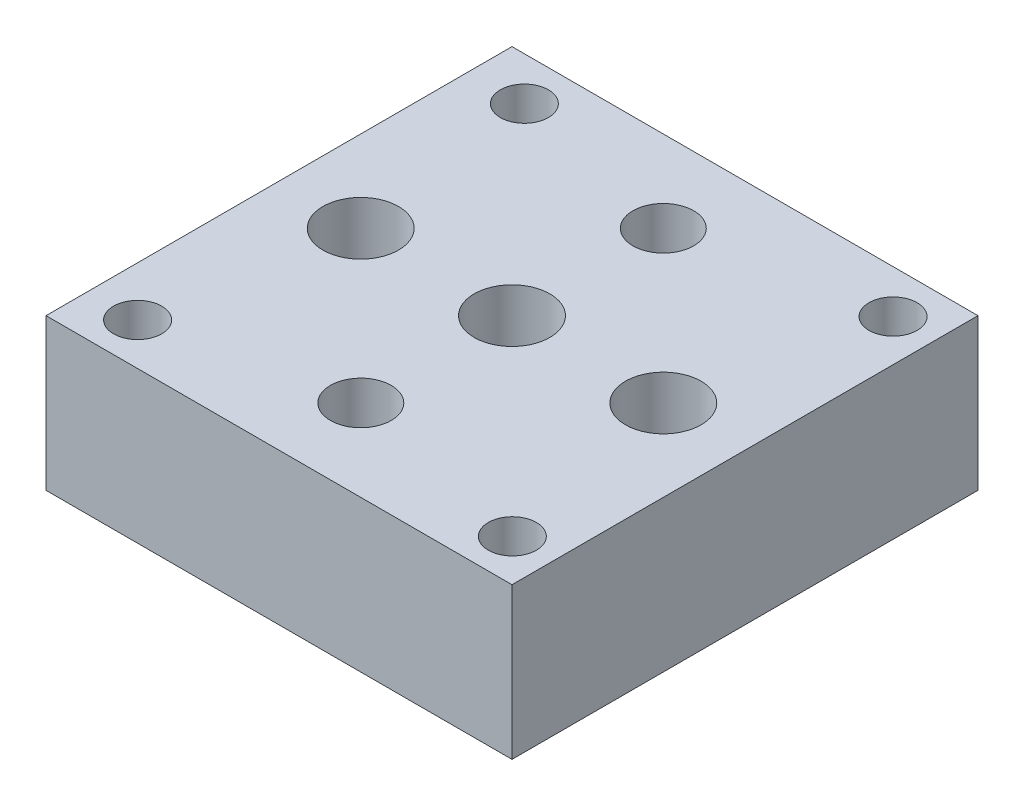
ISO-10303-21;
HEADER;
FILE_DESCRIPTION(('STEP AP214'),'2;1');
FILE_NAME('part.step','',(''),(''),'','','');
FILE_SCHEMA(('AUTOMOTIVE_DESIGN { 1 0 10303 214 1 1 1 1 }'));
ENDSEC;
DATA;
#1=APPLICATION_CONTEXT('core data for automotive mechanical design processes');
#2=APPLICATION_PROTOCOL_DEFINITION('international standard','automotive_design',2000,#1);
#3=PRODUCT_CONTEXT('',#1,'mechanical');
#4=PRODUCT('Part','Part','',(#3));
#5=PRODUCT_RELATED_PRODUCT_CATEGORY('part','',(#4));
#6=PRODUCT_DEFINITION_FORMATION('','',#4);
#7=PRODUCT_DEFINITION_CONTEXT('part definition',#1,'design');
#8=PRODUCT_DEFINITION('design','',#6,#7);
#9=PRODUCT_DEFINITION_SHAPE('','',#8);
#10=(LENGTH_UNIT() NAMED_UNIT(*) SI_UNIT(.MILLI.,.METRE.));
#11=(NAMED_UNIT(*) PLANE_ANGLE_UNIT() SI_UNIT($,.RADIAN.));
#12=(NAMED_UNIT(*) SI_UNIT($,.STERADIAN.) SOLID_ANGLE_UNIT());
#13=UNCERTAINTY_MEASURE_WITH_UNIT(LENGTH_MEASURE(1.E-05),#10,'distance_accuracy_value','');
#14=(GEOMETRIC_REPRESENTATION_CONTEXT(3) GLOBAL_UNCERTAINTY_ASSIGNED_CONTEXT((#13)) GLOBAL_UNIT_ASSIGNED_CONTEXT((#10,
#11,#12)) REPRESENTATION_CONTEXT('',''));
#15=CARTESIAN_POINT('',(0.,0.,0.));
#16=DIRECTION('',(0.,0.,1.));
#17=DIRECTION('',(1.,0.,0.));
#18=AXIS2_PLACEMENT_3D('',#15,#16,#17);
#19=CARTESIAN_POINT('',(19.558,12.7,-19.558));
#20=DIRECTION('',(-1.,0.,0.));
#21=DIRECTION('',(0.,0.,1.));
#22=AXIS2_PLACEMENT_3D('',#19,#20,#21);
#23=PLANE('',#22);
#24=DIRECTION('',(0.,0.,-1.));
#25=VECTOR('',#24,1.);
#26=CARTESIAN_POINT('',(19.558,0.,-19.558));
#27=LINE('',#26,#25);
#28=CARTESIAN_POINT('',(19.558,0.,19.558));
#29=VERTEX_POINT('',#28);
#30=CARTESIAN_POINT('',(19.558,0.,-19.558));
#31=VERTEX_POINT('',#30);
#32=EDGE_CURVE('E98',#29,#31,#27,.T.);
#33=ORIENTED_EDGE('',*,*,#32,.T.);
#34=DIRECTION('',(0.,-1.,0.));
#35=VECTOR('',#34,1.);
#36=CARTESIAN_POINT('',(19.558,12.7,-19.558));
#37=LINE('',#36,#35);
#38=CARTESIAN_POINT('',(19.558,12.7,-19.558));
#39=VERTEX_POINT('',#38);
#40=EDGE_CURVE('E11',#39,#31,#37,.T.);
#41=ORIENTED_EDGE('',*,*,#40,.F.);
#42=DIRECTION('',(0.,0.,-1.));
#43=VECTOR('',#42,1.);
#44=CARTESIAN_POINT('',(19.558,12.7,-19.558));
#45=LINE('',#44,#43);
#46=CARTESIAN_POINT('',(19.558,12.7,19.558));
#47=VERTEX_POINT('',#46);
#48=EDGE_CURVE('E86',#47,#39,#45,.T.);
#49=ORIENTED_EDGE('',*,*,#48,.F.);
#50=DIRECTION('',(0.,-1.,0.));
#51=VECTOR('',#50,1.);
#52=CARTESIAN_POINT('',(19.558,12.7,19.558));
#53=LINE('',#52,#51);
#54=EDGE_CURVE('E94',#47,#29,#53,.T.);
#55=ORIENTED_EDGE('',*,*,#54,.T.);
#56=EDGE_LOOP('',(#33,#41,#49,#55));
#57=FACE_BOUND('',#56,.T.);
#58=ADVANCED_FACE('F35',(#57),#23,.F.);
#59=CARTESIAN_POINT('',(-19.558,12.7,-19.558));
#60=DIRECTION('',(0.,0.,1.));
#61=DIRECTION('',(1.,0.,0.));
#62=AXIS2_PLACEMENT_3D('',#59,#60,#61);
#63=PLANE('',#62);
#64=DIRECTION('',(-1.,0.,0.));
#65=VECTOR('',#64,1.);
#66=CARTESIAN_POINT('',(-19.558,0.,-19.558));
#67=LINE('',#66,#65);
#68=CARTESIAN_POINT('',(-19.558,0.,-19.558));
#69=VERTEX_POINT('',#68);
#70=EDGE_CURVE('E90',#31,#69,#67,.T.);
#71=ORIENTED_EDGE('',*,*,#70,.T.);
#72=DIRECTION('',(0.,-1.,0.));
#73=VECTOR('',#72,1.);
#74=CARTESIAN_POINT('',(-19.558,12.7,-19.558));
#75=LINE('',#74,#73);
#76=CARTESIAN_POINT('',(-19.558,12.7,-19.558));
#77=VERTEX_POINT('',#76);
#78=EDGE_CURVE('E43',#77,#69,#75,.T.);
#79=ORIENTED_EDGE('',*,*,#78,.F.);
#80=DIRECTION('',(-1.,0.,0.));
#81=VECTOR('',#80,1.);
#82=CARTESIAN_POINT('',(-19.558,12.7,-19.558));
#83=LINE('',#82,#81);
#84=EDGE_CURVE('E81',#39,#77,#83,.T.);
#85=ORIENTED_EDGE('',*,*,#84,.F.);
#86=ORIENTED_EDGE('',*,*,#40,.T.);
#87=EDGE_LOOP('',(#71,#79,#85,#86));
#88=FACE_BOUND('',#87,.T.);
#89=ADVANCED_FACE('F89',(#88),#63,.F.);
#90=CARTESIAN_POINT('',(-19.558,12.7,-19.558));
#91=DIRECTION('',(1.,0.,0.));
#92=DIRECTION('',(0.,0.,-1.));
#93=AXIS2_PLACEMENT_3D('',#90,#91,#92);
#94=PLANE('',#93);
#95=DIRECTION('',(0.,0.,1.));
#96=VECTOR('',#95,1.);
#97=CARTESIAN_POINT('',(-19.558,0.,-19.558));
#98=LINE('',#97,#96);
#99=CARTESIAN_POINT('',(-19.558,0.,19.558));
#100=VERTEX_POINT('',#99);
#101=EDGE_CURVE('E68',#69,#100,#98,.T.);
#102=ORIENTED_EDGE('',*,*,#101,.T.);
#103=DIRECTION('',(0.,-1.,0.));
#104=VECTOR('',#103,1.);
#105=CARTESIAN_POINT('',(-19.558,12.7,19.558));
#106=LINE('',#105,#104);
#107=CARTESIAN_POINT('',(-19.558,12.7,19.558));
#108=VERTEX_POINT('',#107);
#109=EDGE_CURVE('E91',#108,#100,#106,.T.);
#110=ORIENTED_EDGE('',*,*,#109,.F.);
#111=DIRECTION('',(0.,0.,1.));
#112=VECTOR('',#111,1.);
#113=CARTESIAN_POINT('',(-19.558,12.7,-19.558));
#114=LINE('',#113,#112);
#115=EDGE_CURVE('E84',#77,#108,#114,.T.);
#116=ORIENTED_EDGE('',*,*,#115,.F.);
#117=ORIENTED_EDGE('',*,*,#78,.T.);
#118=EDGE_LOOP('',(#102,#110,#116,#117));
#119=FACE_BOUND('',#118,.T.);
#120=ADVANCED_FACE('F92',(#119),#94,.F.);
#121=CARTESIAN_POINT('',(-19.558,12.7,19.558));
#122=DIRECTION('',(0.,0.,-1.));
#123=DIRECTION('',(-1.,0.,0.));
#124=AXIS2_PLACEMENT_3D('',#121,#122,#123);
#125=PLANE('',#124);
#126=DIRECTION('',(1.,0.,0.));
#127=VECTOR('',#126,1.);
#128=CARTESIAN_POINT('',(-19.558,0.,19.558));
#129=LINE('',#128,#127);
#130=EDGE_CURVE('E74',#100,#29,#129,.T.);
#131=ORIENTED_EDGE('',*,*,#130,.T.);
#132=ORIENTED_EDGE('',*,*,#54,.F.);
#133=DIRECTION('',(1.,0.,0.));
#134=VECTOR('',#133,1.);
#135=CARTESIAN_POINT('',(-19.558,12.7,19.558));
#136=LINE('',#135,#134);
#137=EDGE_CURVE('E51',#108,#47,#136,.T.);
#138=ORIENTED_EDGE('',*,*,#137,.F.);
#139=ORIENTED_EDGE('',*,*,#109,.T.);
#140=EDGE_LOOP('',(#131,#132,#138,#139));
#141=FACE_BOUND('',#140,.T.);
#142=ADVANCED_FACE('F106',(#141),#125,.F.);
#143=CARTESIAN_POINT('',(0.,12.7,0.));
#144=DIRECTION('',(0.,1.,0.));
#145=DIRECTION('',(0.,0.,1.));
#146=AXIS2_PLACEMENT_3D('',#143,#144,#145);
#147=PLANE('',#146);
#148=CARTESIAN_POINT('',(0.,12.7,-12.7));
#149=DIRECTION('',(0.,1.,0.));
#150=DIRECTION('',(0.,0.,1.));
#151=AXIS2_PLACEMENT_3D('',#148,#149,#150);
#152=CIRCLE('',#151,2.55269999999999);
#153=CARTESIAN_POINT('',(0.,12.7,-10.1473));
#154=VERTEX_POINT('',#153);
#155=EDGE_CURVE('E162',#154,#154,#152,.T.);
#156=ORIENTED_EDGE('',*,*,#155,.F.);
#157=EDGE_LOOP('',(#156));
#158=FACE_BOUND('',#157,.T.);
#159=CARTESIAN_POINT('',(0.,12.7,12.6906819658927));
#160=DIRECTION('',(0.,1.,0.));
#161=DIRECTION('',(0.,0.,1.));
#162=AXIS2_PLACEMENT_3D('',#159,#160,#161);
#163=CIRCLE('',#162,2.55269999999999);
#164=CARTESIAN_POINT('',(0.,12.7,15.2433819658927));
#165=VERTEX_POINT('',#164);
#166=EDGE_CURVE('E156',#165,#165,#163,.T.);
#167=ORIENTED_EDGE('',*,*,#166,.F.);
#168=EDGE_LOOP('',(#167));
#169=FACE_BOUND('',#168,.T.);
#170=CARTESIAN_POINT('',(-12.7,12.7,0.));
#171=DIRECTION('',(0.,1.,0.));
#172=DIRECTION('',(0.,0.,1.));
#173=AXIS2_PLACEMENT_3D('',#170,#171,#172);
#174=CIRCLE('',#173,3.17499999999999);
#175=CARTESIAN_POINT('',(-12.7,12.7,3.17499999999999));
#176=VERTEX_POINT('',#175);
#177=EDGE_CURVE('E150',#176,#176,#174,.T.);
#178=ORIENTED_EDGE('',*,*,#177,.F.);
#179=EDGE_LOOP('',(#178));
#180=FACE_BOUND('',#179,.T.);
#181=CARTESIAN_POINT('',(12.7,12.7,0.));
#182=DIRECTION('',(0.,1.,0.));
#183=DIRECTION('',(0.,0.,1.));
#184=AXIS2_PLACEMENT_3D('',#181,#182,#183);
#185=CIRCLE('',#184,3.17499999999999);
#186=CARTESIAN_POINT('',(12.7,12.7,3.17499999999999));
#187=VERTEX_POINT('',#186);
#188=EDGE_CURVE('E144',#187,#187,#185,.T.);
#189=ORIENTED_EDGE('',*,*,#188,.F.);
#190=EDGE_LOOP('',(#189));
#191=FACE_BOUND('',#190,.T.);
#192=CARTESIAN_POINT('',(0.,12.7,0.));
#193=DIRECTION('',(0.,1.,0.));
#194=DIRECTION('',(0.,0.,1.));
#195=AXIS2_PLACEMENT_3D('',#192,#193,#194);
#196=CIRCLE('',#195,3.17499999999999);
#197=CARTESIAN_POINT('',(0.,12.7,3.17499999999999));
#198=VERTEX_POINT('',#197);
#199=EDGE_CURVE('E138',#198,#198,#196,.T.);
#200=ORIENTED_EDGE('',*,*,#199,.F.);
#201=EDGE_LOOP('',(#200));
#202=FACE_BOUND('',#201,.T.);
#203=CARTESIAN_POINT('',(-14.89,12.7,-15.928));
#204=DIRECTION('',(0.,1.,0.));
#205=DIRECTION('',(0.,0.,1.));
#206=AXIS2_PLACEMENT_3D('',#203,#204,#205);
#207=CIRCLE('',#206,2.0193);
#208=CARTESIAN_POINT('',(-14.89,12.7,-13.9087));
#209=VERTEX_POINT('',#208);
#210=EDGE_CURVE('E132',#209,#209,#207,.T.);
#211=ORIENTED_EDGE('',*,*,#210,.F.);
#212=EDGE_LOOP('',(#211));
#213=FACE_BOUND('',#212,.T.);
#214=CARTESIAN_POINT('',(-15.398,12.7,16.028));
#215=DIRECTION('',(0.,1.,0.));
#216=DIRECTION('',(0.,0.,1.));
#217=AXIS2_PLACEMENT_3D('',#214,#215,#216);
#218=CIRCLE('',#217,2.0193);
#219=CARTESIAN_POINT('',(-15.398,12.7,18.0473));
#220=VERTEX_POINT('',#219);
#221=EDGE_CURVE('E126',#220,#220,#218,.T.);
#222=ORIENTED_EDGE('',*,*,#221,.F.);
#223=EDGE_LOOP('',(#222));
#224=FACE_BOUND('',#223,.T.);
#225=CARTESIAN_POINT('',(16.0580000000001,12.7,16.028));
#226=DIRECTION('',(0.,1.,0.));
#227=DIRECTION('',(0.,0.,1.));
#228=AXIS2_PLACEMENT_3D('',#225,#226,#227);
#229=CIRCLE('',#228,2.0193);
#230=CARTESIAN_POINT('',(16.0580000000001,12.7,18.0473));
#231=VERTEX_POINT('',#230);
#232=EDGE_CURVE('E120',#231,#231,#229,.T.);
#233=ORIENTED_EDGE('',*,*,#232,.F.);
#234=EDGE_LOOP('',(#233));
#235=FACE_BOUND('',#234,.T.);
#236=CARTESIAN_POINT('',(16.058,12.7,-15.928));
#237=DIRECTION('',(0.,1.,0.));
#238=DIRECTION('',(0.,0.,1.));
#239=AXIS2_PLACEMENT_3D('',#236,#237,#238);
#240=CIRCLE('',#239,2.0193);
#241=CARTESIAN_POINT('',(16.058,12.7,-13.9087));
#242=VERTEX_POINT('',#241);
#243=EDGE_CURVE('E114',#242,#242,#240,.T.);
#244=ORIENTED_EDGE('',*,*,#243,.F.);
#245=EDGE_LOOP('',(#244));
#246=FACE_BOUND('',#245,.T.);
#247=ORIENTED_EDGE('',*,*,#48,.T.);
#248=ORIENTED_EDGE('',*,*,#84,.T.);
#249=ORIENTED_EDGE('',*,*,#115,.T.);
#250=ORIENTED_EDGE('',*,*,#137,.T.);
#251=EDGE_LOOP('',(#247,#248,#249,#250));
#252=FACE_BOUND('',#251,.T.);
#253=ADVANCED_FACE('F82',(#158,#169,#180,#191,#202,#213,#224,#235,#246,#252),#147,.T.);
#254=CARTESIAN_POINT('',(0.,0.,0.));
#255=DIRECTION('',(0.,1.,0.));
#256=DIRECTION('',(0.,0.,1.));
#257=AXIS2_PLACEMENT_3D('',#254,#255,#256);
#258=PLANE('',#257);
#259=CARTESIAN_POINT('',(0.,0.,-12.7));
#260=DIRECTION('',(0.,1.,0.));
#261=DIRECTION('',(0.,0.,1.));
#262=AXIS2_PLACEMENT_3D('',#259,#260,#261);
#263=CIRCLE('',#262,2.55269999999999);
#264=CARTESIAN_POINT('',(0.,0.,-10.1473));
#265=VERTEX_POINT('',#264);
#266=EDGE_CURVE('E159',#265,#265,#263,.T.);
#267=ORIENTED_EDGE('',*,*,#266,.T.);
#268=EDGE_LOOP('',(#267));
#269=FACE_BOUND('',#268,.T.);
#270=CARTESIAN_POINT('',(0.,0.,12.6906819658927));
#271=DIRECTION('',(0.,1.,0.));
#272=DIRECTION('',(0.,0.,1.));
#273=AXIS2_PLACEMENT_3D('',#270,#271,#272);
#274=CIRCLE('',#273,2.55269999999999);
#275=CARTESIAN_POINT('',(0.,0.,15.2433819658927));
#276=VERTEX_POINT('',#275);
#277=EDGE_CURVE('E153',#276,#276,#274,.T.);
#278=ORIENTED_EDGE('',*,*,#277,.T.);
#279=EDGE_LOOP('',(#278));
#280=FACE_BOUND('',#279,.T.);
#281=CARTESIAN_POINT('',(-12.7,0.,0.));
#282=DIRECTION('',(0.,1.,0.));
#283=DIRECTION('',(0.,0.,1.));
#284=AXIS2_PLACEMENT_3D('',#281,#282,#283);
#285=CIRCLE('',#284,3.17499999999999);
#286=CARTESIAN_POINT('',(-12.7,0.,3.17499999999999));
#287=VERTEX_POINT('',#286);
#288=EDGE_CURVE('E147',#287,#287,#285,.T.);
#289=ORIENTED_EDGE('',*,*,#288,.T.);
#290=EDGE_LOOP('',(#289));
#291=FACE_BOUND('',#290,.T.);
#292=CARTESIAN_POINT('',(12.7,0.,0.));
#293=DIRECTION('',(0.,1.,0.));
#294=DIRECTION('',(0.,0.,1.));
#295=AXIS2_PLACEMENT_3D('',#292,#293,#294);
#296=CIRCLE('',#295,3.17499999999999);
#297=CARTESIAN_POINT('',(12.7,0.,3.17499999999999));
#298=VERTEX_POINT('',#297);
#299=EDGE_CURVE('E141',#298,#298,#296,.T.);
#300=ORIENTED_EDGE('',*,*,#299,.T.);
#301=EDGE_LOOP('',(#300));
#302=FACE_BOUND('',#301,.T.);
#303=CARTESIAN_POINT('',(0.,0.,0.));
#304=DIRECTION('',(0.,1.,0.));
#305=DIRECTION('',(0.,0.,1.));
#306=AXIS2_PLACEMENT_3D('',#303,#304,#305);
#307=CIRCLE('',#306,3.17499999999999);
#308=CARTESIAN_POINT('',(0.,0.,3.17499999999999));
#309=VERTEX_POINT('',#308);
#310=EDGE_CURVE('E135',#309,#309,#307,.T.);
#311=ORIENTED_EDGE('',*,*,#310,.T.);
#312=EDGE_LOOP('',(#311));
#313=FACE_BOUND('',#312,.T.);
#314=CARTESIAN_POINT('',(-14.89,0.,-15.928));
#315=DIRECTION('',(0.,1.,0.));
#316=DIRECTION('',(0.,0.,1.));
#317=AXIS2_PLACEMENT_3D('',#314,#315,#316);
#318=CIRCLE('',#317,2.0193);
#319=CARTESIAN_POINT('',(-14.89,0.,-13.9087));
#320=VERTEX_POINT('',#319);
#321=EDGE_CURVE('E129',#320,#320,#318,.T.);
#322=ORIENTED_EDGE('',*,*,#321,.T.);
#323=EDGE_LOOP('',(#322));
#324=FACE_BOUND('',#323,.T.);
#325=CARTESIAN_POINT('',(-15.398,0.,16.028));
#326=DIRECTION('',(0.,1.,0.));
#327=DIRECTION('',(0.,0.,1.));
#328=AXIS2_PLACEMENT_3D('',#325,#326,#327);
#329=CIRCLE('',#328,2.0193);
#330=CARTESIAN_POINT('',(-15.398,0.,18.0473));
#331=VERTEX_POINT('',#330);
#332=EDGE_CURVE('E123',#331,#331,#329,.T.);
#333=ORIENTED_EDGE('',*,*,#332,.T.);
#334=EDGE_LOOP('',(#333));
#335=FACE_BOUND('',#334,.T.);
#336=CARTESIAN_POINT('',(16.0580000000001,0.,16.028));
#337=DIRECTION('',(0.,1.,0.));
#338=DIRECTION('',(0.,0.,1.));
#339=AXIS2_PLACEMENT_3D('',#336,#337,#338);
#340=CIRCLE('',#339,2.0193);
#341=CARTESIAN_POINT('',(16.0580000000001,0.,18.0473));
#342=VERTEX_POINT('',#341);
#343=EDGE_CURVE('E117',#342,#342,#340,.T.);
#344=ORIENTED_EDGE('',*,*,#343,.T.);
#345=EDGE_LOOP('',(#344));
#346=FACE_BOUND('',#345,.T.);
#347=CARTESIAN_POINT('',(16.058,0.,-15.928));
#348=DIRECTION('',(0.,1.,0.));
#349=DIRECTION('',(0.,0.,1.));
#350=AXIS2_PLACEMENT_3D('',#347,#348,#349);
#351=CIRCLE('',#350,2.0193);
#352=CARTESIAN_POINT('',(16.058,0.,-13.9087));
#353=VERTEX_POINT('',#352);
#354=EDGE_CURVE('E101',#353,#353,#351,.T.);
#355=ORIENTED_EDGE('',*,*,#354,.T.);
#356=EDGE_LOOP('',(#355));
#357=FACE_BOUND('',#356,.T.);
#358=ORIENTED_EDGE('',*,*,#32,.F.);
#359=ORIENTED_EDGE('',*,*,#130,.F.);
#360=ORIENTED_EDGE('',*,*,#101,.F.);
#361=ORIENTED_EDGE('',*,*,#70,.F.);
#362=EDGE_LOOP('',(#358,#359,#360,#361));
#363=FACE_BOUND('',#362,.T.);
#364=ADVANCED_FACE('F109',(#269,#280,#291,#302,#313,#324,#335,#346,#357,#363),#258,.F.);
#365=CARTESIAN_POINT('',(16.058,12.7,-15.928));
#366=DIRECTION('',(0.,1.,0.));
#367=DIRECTION('',(0.,0.,1.));
#368=AXIS2_PLACEMENT_3D('',#365,#366,#367);
#369=CYLINDRICAL_SURFACE('',#368,2.0193);
#370=ORIENTED_EDGE('',*,*,#354,.F.);
#371=EDGE_LOOP('',(#370));
#372=FACE_BOUND('',#371,.T.);
#373=ORIENTED_EDGE('',*,*,#243,.T.);
#374=EDGE_LOOP('',(#373));
#375=FACE_BOUND('',#374,.T.);
#376=ADVANCED_FACE('F187',(#372,#375),#369,.F.);
#377=CARTESIAN_POINT('',(16.0580000000001,12.7,16.028));
#378=DIRECTION('',(0.,1.,0.));
#379=DIRECTION('',(0.,0.,1.));
#380=AXIS2_PLACEMENT_3D('',#377,#378,#379);
#381=CYLINDRICAL_SURFACE('',#380,2.0193);
#382=ORIENTED_EDGE('',*,*,#343,.F.);
#383=EDGE_LOOP('',(#382));
#384=FACE_BOUND('',#383,.T.);
#385=ORIENTED_EDGE('',*,*,#232,.T.);
#386=EDGE_LOOP('',(#385));
#387=FACE_BOUND('',#386,.T.);
#388=ADVANCED_FACE('F189',(#384,#387),#381,.F.);
#389=CARTESIAN_POINT('',(-15.398,12.7,16.028));
#390=DIRECTION('',(0.,1.,0.));
#391=DIRECTION('',(0.,0.,1.));
#392=AXIS2_PLACEMENT_3D('',#389,#390,#391);
#393=CYLINDRICAL_SURFACE('',#392,2.0193);
#394=ORIENTED_EDGE('',*,*,#332,.F.);
#395=EDGE_LOOP('',(#394));
#396=FACE_BOUND('',#395,.T.);
#397=ORIENTED_EDGE('',*,*,#221,.T.);
#398=EDGE_LOOP('',(#397));
#399=FACE_BOUND('',#398,.T.);
#400=ADVANCED_FACE('F196',(#396,#399),#393,.F.);
#401=CARTESIAN_POINT('',(-14.89,12.7,-15.928));
#402=DIRECTION('',(0.,1.,0.));
#403=DIRECTION('',(0.,0.,1.));
#404=AXIS2_PLACEMENT_3D('',#401,#402,#403);
#405=CYLINDRICAL_SURFACE('',#404,2.0193);
#406=ORIENTED_EDGE('',*,*,#321,.F.);
#407=EDGE_LOOP('',(#406));
#408=FACE_BOUND('',#407,.T.);
#409=ORIENTED_EDGE('',*,*,#210,.T.);
#410=EDGE_LOOP('',(#409));
#411=FACE_BOUND('',#410,.T.);
#412=ADVANCED_FACE('F273',(#408,#411),#405,.F.);
#413=CARTESIAN_POINT('',(0.,12.7,0.));
#414=DIRECTION('',(0.,1.,0.));
#415=DIRECTION('',(0.,0.,1.));
#416=AXIS2_PLACEMENT_3D('',#413,#414,#415);
#417=CYLINDRICAL_SURFACE('',#416,3.17499999999999);
#418=ORIENTED_EDGE('',*,*,#310,.F.);
#419=EDGE_LOOP('',(#418));
#420=FACE_BOUND('',#419,.T.);
#421=ORIENTED_EDGE('',*,*,#199,.T.);
#422=EDGE_LOOP('',(#421));
#423=FACE_BOUND('',#422,.T.);
#424=ADVANCED_FACE('F265',(#420,#423),#417,.F.);
#425=CARTESIAN_POINT('',(12.7,12.7,0.));
#426=DIRECTION('',(0.,1.,0.));
#427=DIRECTION('',(0.,0.,1.));
#428=AXIS2_PLACEMENT_3D('',#425,#426,#427);
#429=CYLINDRICAL_SURFACE('',#428,3.17499999999999);
#430=ORIENTED_EDGE('',*,*,#299,.F.);
#431=EDGE_LOOP('',(#430));
#432=FACE_BOUND('',#431,.T.);
#433=ORIENTED_EDGE('',*,*,#188,.T.);
#434=EDGE_LOOP('',(#433));
#435=FACE_BOUND('',#434,.T.);
#436=ADVANCED_FACE('F258',(#432,#435),#429,.F.);
#437=CARTESIAN_POINT('',(-12.7,12.7,0.));
#438=DIRECTION('',(0.,1.,0.));
#439=DIRECTION('',(0.,0.,1.));
#440=AXIS2_PLACEMENT_3D('',#437,#438,#439);
#441=CYLINDRICAL_SURFACE('',#440,3.17499999999999);
#442=ORIENTED_EDGE('',*,*,#288,.F.);
#443=EDGE_LOOP('',(#442));
#444=FACE_BOUND('',#443,.T.);
#445=ORIENTED_EDGE('',*,*,#177,.T.);
#446=EDGE_LOOP('',(#445));
#447=FACE_BOUND('',#446,.T.);
#448=ADVANCED_FACE('F237',(#444,#447),#441,.F.);
#449=CARTESIAN_POINT('',(0.,12.7,12.6906819658927));
#450=DIRECTION('',(0.,1.,0.));
#451=DIRECTION('',(0.,0.,1.));
#452=AXIS2_PLACEMENT_3D('',#449,#450,#451);
#453=CYLINDRICAL_SURFACE('',#452,2.55269999999999);
#454=ORIENTED_EDGE('',*,*,#277,.F.);
#455=EDGE_LOOP('',(#454));
#456=FACE_BOUND('',#455,.T.);
#457=ORIENTED_EDGE('',*,*,#166,.T.);
#458=EDGE_LOOP('',(#457));
#459=FACE_BOUND('',#458,.T.);
#460=ADVANCED_FACE('F231',(#456,#459),#453,.F.);
#461=CARTESIAN_POINT('',(0.,12.7,-12.7));
#462=DIRECTION('',(0.,1.,0.));
#463=DIRECTION('',(0.,0.,1.));
#464=AXIS2_PLACEMENT_3D('',#461,#462,#463);
#465=CYLINDRICAL_SURFACE('',#464,2.55269999999999);
#466=ORIENTED_EDGE('',*,*,#266,.F.);
#467=EDGE_LOOP('',(#466));
#468=FACE_BOUND('',#467,.T.);
#469=ORIENTED_EDGE('',*,*,#155,.T.);
#470=EDGE_LOOP('',(#469));
#471=FACE_BOUND('',#470,.T.);
#472=ADVANCED_FACE('F166',(#468,#471),#465,.F.);
#473=CLOSED_SHELL('',(#58,#89,#120,#142,#253,#364,#376,#388,#400,#412,#424,#436,#448,#460,#472));
#474=MANIFOLD_SOLID_BREP('B2',#473);
#475=ADVANCED_BREP_SHAPE_REPRESENTATION('',(#18,#474),#14);
#476=SHAPE_DEFINITION_REPRESENTATION(#9,#475);
ENDSEC;
END-ISO-10303-21;
